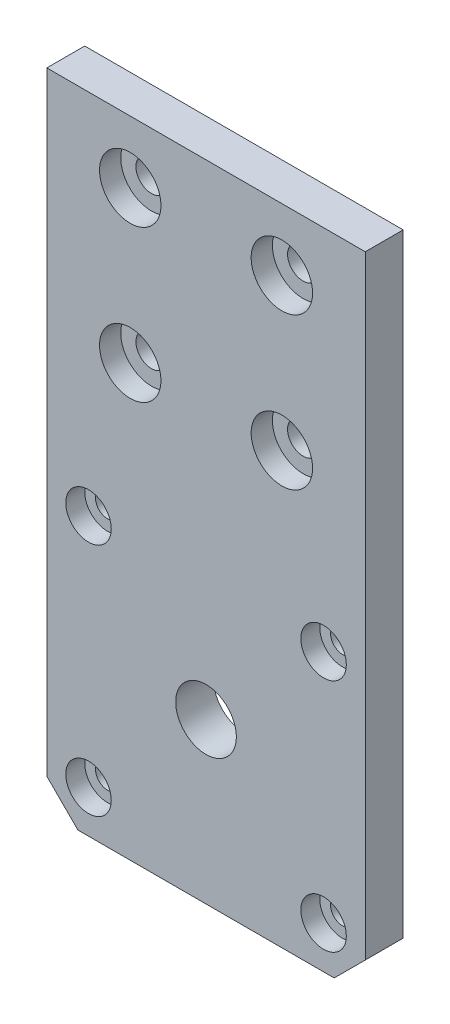
ISO-10303-21;
HEADER;
FILE_DESCRIPTION(('STEP AP214'),'2;1');
FILE_NAME('part.step','',(''),(''),'','','');
FILE_SCHEMA(('AUTOMOTIVE_DESIGN { 1 0 10303 214 1 1 1 1 }'));
ENDSEC;
DATA;
#1=APPLICATION_CONTEXT('core data for automotive mechanical design processes');
#2=APPLICATION_PROTOCOL_DEFINITION('international standard','automotive_design',2000,#1);
#3=PRODUCT_CONTEXT('',#1,'mechanical');
#4=PRODUCT('Part','Part','',(#3));
#5=PRODUCT_RELATED_PRODUCT_CATEGORY('part','',(#4));
#6=PRODUCT_DEFINITION_FORMATION('','',#4);
#7=PRODUCT_DEFINITION_CONTEXT('part definition',#1,'design');
#8=PRODUCT_DEFINITION('design','',#6,#7);
#9=PRODUCT_DEFINITION_SHAPE('','',#8);
#10=(LENGTH_UNIT() NAMED_UNIT(*) SI_UNIT(.MILLI.,.METRE.));
#11=(NAMED_UNIT(*) PLANE_ANGLE_UNIT() SI_UNIT($,.RADIAN.));
#12=(NAMED_UNIT(*) SI_UNIT($,.STERADIAN.) SOLID_ANGLE_UNIT());
#13=UNCERTAINTY_MEASURE_WITH_UNIT(LENGTH_MEASURE(1.E-05),#10,'distance_accuracy_value','');
#14=(GEOMETRIC_REPRESENTATION_CONTEXT(3) GLOBAL_UNCERTAINTY_ASSIGNED_CONTEXT((#13)) GLOBAL_UNIT_ASSIGNED_CONTEXT((#10,
#11,#12)) REPRESENTATION_CONTEXT('',''));
#15=CARTESIAN_POINT('',(0.,0.,0.));
#16=DIRECTION('',(0.,0.,1.));
#17=DIRECTION('',(1.,0.,0.));
#18=AXIS2_PLACEMENT_3D('',#15,#16,#17);
#19=CARTESIAN_POINT('',(5.50000000000001,5.58,0.));
#20=DIRECTION('',(0.,0.,1.));
#21=DIRECTION('',(1.,0.,0.));
#22=AXIS2_PLACEMENT_3D('',#19,#20,#21);
#23=CYLINDRICAL_SURFACE('',#22,1.575);
#24=CARTESIAN_POINT('',(5.50000000000001,5.58,0.));
#25=DIRECTION('',(0.,0.,1.));
#26=DIRECTION('',(1.,0.,0.));
#27=AXIS2_PLACEMENT_3D('',#24,#25,#26);
#28=CIRCLE('',#27,1.575);
#29=CARTESIAN_POINT('',(7.07500000000001,5.58,0.));
#30=VERTEX_POINT('',#29);
#31=EDGE_CURVE('E223',#30,#30,#28,.T.);
#32=ORIENTED_EDGE('',*,*,#31,.F.);
#33=EDGE_LOOP('',(#32));
#34=FACE_BOUND('',#33,.T.);
#35=CARTESIAN_POINT('',(5.50000000000001,5.58,2.5));
#36=DIRECTION('',(0.,0.,1.));
#37=DIRECTION('',(1.,0.,0.));
#38=AXIS2_PLACEMENT_3D('',#35,#36,#37);
#39=CIRCLE('',#38,1.575);
#40=CARTESIAN_POINT('',(7.07500000000001,5.58,2.5));
#41=VERTEX_POINT('',#40);
#42=EDGE_CURVE('E160',#41,#41,#39,.F.);
#43=ORIENTED_EDGE('',*,*,#42,.F.);
#44=EDGE_LOOP('',(#43));
#45=FACE_BOUND('',#44,.T.);
#46=ADVANCED_FACE('F34',(#34,#45),#23,.F.);
#47=CARTESIAN_POINT('',(36.5,5.58000000000001,0.));
#48=DIRECTION('',(0.,0.,1.));
#49=DIRECTION('',(1.,0.,0.));
#50=AXIS2_PLACEMENT_3D('',#47,#48,#49);
#51=CYLINDRICAL_SURFACE('',#50,1.575);
#52=CARTESIAN_POINT('',(36.5,5.58000000000001,0.));
#53=DIRECTION('',(0.,0.,1.));
#54=DIRECTION('',(1.,0.,0.));
#55=AXIS2_PLACEMENT_3D('',#52,#53,#54);
#56=CIRCLE('',#55,1.575);
#57=CARTESIAN_POINT('',(38.075,5.58000000000001,0.));
#58=VERTEX_POINT('',#57);
#59=EDGE_CURVE('E220',#58,#58,#56,.T.);
#60=ORIENTED_EDGE('',*,*,#59,.F.);
#61=EDGE_LOOP('',(#60));
#62=FACE_BOUND('',#61,.T.);
#63=CARTESIAN_POINT('',(36.5,5.58000000000001,2.5));
#64=DIRECTION('',(0.,0.,1.));
#65=DIRECTION('',(1.,0.,0.));
#66=AXIS2_PLACEMENT_3D('',#63,#64,#65);
#67=CIRCLE('',#66,1.575);
#68=CARTESIAN_POINT('',(38.075,5.58000000000001,2.5));
#69=VERTEX_POINT('',#68);
#70=EDGE_CURVE('E155',#69,#69,#67,.F.);
#71=ORIENTED_EDGE('',*,*,#70,.F.);
#72=EDGE_LOOP('',(#71));
#73=FACE_BOUND('',#72,.T.);
#74=ADVANCED_FACE('F295',(#62,#73),#51,.F.);
#75=CARTESIAN_POINT('',(36.5,36.58,0.));
#76=DIRECTION('',(0.,0.,1.));
#77=DIRECTION('',(1.,0.,0.));
#78=AXIS2_PLACEMENT_3D('',#75,#76,#77);
#79=CYLINDRICAL_SURFACE('',#78,1.575);
#80=CARTESIAN_POINT('',(36.5,36.58,0.));
#81=DIRECTION('',(0.,0.,1.));
#82=DIRECTION('',(1.,0.,0.));
#83=AXIS2_PLACEMENT_3D('',#80,#81,#82);
#84=CIRCLE('',#83,1.575);
#85=CARTESIAN_POINT('',(38.075,36.58,0.));
#86=VERTEX_POINT('',#85);
#87=EDGE_CURVE('E217',#86,#86,#84,.T.);
#88=ORIENTED_EDGE('',*,*,#87,.F.);
#89=EDGE_LOOP('',(#88));
#90=FACE_BOUND('',#89,.T.);
#91=CARTESIAN_POINT('',(36.5,36.58,2.5));
#92=DIRECTION('',(0.,0.,1.));
#93=DIRECTION('',(1.,0.,0.));
#94=AXIS2_PLACEMENT_3D('',#91,#92,#93);
#95=CIRCLE('',#94,1.575);
#96=CARTESIAN_POINT('',(38.075,36.58,2.5));
#97=VERTEX_POINT('',#96);
#98=EDGE_CURVE('E150',#97,#97,#95,.F.);
#99=ORIENTED_EDGE('',*,*,#98,.F.);
#100=EDGE_LOOP('',(#99));
#101=FACE_BOUND('',#100,.T.);
#102=ADVANCED_FACE('F301',(#90,#101),#79,.F.);
#103=CARTESIAN_POINT('',(5.5,36.58,0.));
#104=DIRECTION('',(0.,0.,1.));
#105=DIRECTION('',(1.,0.,0.));
#106=AXIS2_PLACEMENT_3D('',#103,#104,#105);
#107=CYLINDRICAL_SURFACE('',#106,1.575);
#108=CARTESIAN_POINT('',(5.5,36.58,0.));
#109=DIRECTION('',(0.,0.,1.));
#110=DIRECTION('',(1.,0.,0.));
#111=AXIS2_PLACEMENT_3D('',#108,#109,#110);
#112=CIRCLE('',#111,1.575);
#113=CARTESIAN_POINT('',(7.075,36.58,0.));
#114=VERTEX_POINT('',#113);
#115=EDGE_CURVE('E212',#114,#114,#112,.T.);
#116=ORIENTED_EDGE('',*,*,#115,.F.);
#117=EDGE_LOOP('',(#116));
#118=FACE_BOUND('',#117,.T.);
#119=CARTESIAN_POINT('',(5.5,36.58,2.5));
#120=DIRECTION('',(0.,0.,1.));
#121=DIRECTION('',(1.,0.,0.));
#122=AXIS2_PLACEMENT_3D('',#119,#120,#121);
#123=CIRCLE('',#122,1.575);
#124=CARTESIAN_POINT('',(7.075,36.58,2.5));
#125=VERTEX_POINT('',#124);
#126=EDGE_CURVE('E145',#125,#125,#123,.F.);
#127=ORIENTED_EDGE('',*,*,#126,.F.);
#128=EDGE_LOOP('',(#127));
#129=FACE_BOUND('',#128,.T.);
#130=ADVANCED_FACE('F312',(#118,#129),#107,.F.);
#131=CARTESIAN_POINT('',(31.,76.8,5.));
#132=DIRECTION('',(0.,0.,-1.));
#133=DIRECTION('',(-1.,0.,0.));
#134=AXIS2_PLACEMENT_3D('',#131,#132,#133);
#135=CYLINDRICAL_SURFACE('',#134,2.04999999999999);
#136=CARTESIAN_POINT('',(31.,76.8,0.));
#137=DIRECTION('',(0.,0.,1.));
#138=DIRECTION('',(1.,0.,0.));
#139=AXIS2_PLACEMENT_3D('',#136,#137,#138);
#140=CIRCLE('',#139,2.04999999999999);
#141=CARTESIAN_POINT('',(33.05,76.8,0.));
#142=VERTEX_POINT('',#141);
#143=EDGE_CURVE('E189',#142,#142,#140,.T.);
#144=ORIENTED_EDGE('',*,*,#143,.F.);
#145=EDGE_LOOP('',(#144));
#146=FACE_BOUND('',#145,.T.);
#147=CARTESIAN_POINT('',(31.,76.8,2.2));
#148=DIRECTION('',(0.,0.,1.));
#149=DIRECTION('',(1.,0.,0.));
#150=AXIS2_PLACEMENT_3D('',#147,#148,#149);
#151=CIRCLE('',#150,2.04999999999999);
#152=CARTESIAN_POINT('',(33.05,76.8,2.2));
#153=VERTEX_POINT('',#152);
#154=EDGE_CURVE('E140',#153,#153,#151,.T.);
#155=ORIENTED_EDGE('',*,*,#154,.T.);
#156=EDGE_LOOP('',(#155));
#157=FACE_BOUND('',#156,.T.);
#158=ADVANCED_FACE('F316',(#146,#157),#135,.F.);
#159=CARTESIAN_POINT('',(31.,56.8,5.));
#160=DIRECTION('',(0.,0.,-1.));
#161=DIRECTION('',(-1.,0.,0.));
#162=AXIS2_PLACEMENT_3D('',#159,#160,#161);
#163=CYLINDRICAL_SURFACE('',#162,2.04999999999999);
#164=CARTESIAN_POINT('',(31.,56.8,0.));
#165=DIRECTION('',(0.,0.,1.));
#166=DIRECTION('',(1.,0.,0.));
#167=AXIS2_PLACEMENT_3D('',#164,#165,#166);
#168=CIRCLE('',#167,2.04999999999999);
#169=CARTESIAN_POINT('',(33.05,56.8,0.));
#170=VERTEX_POINT('',#169);
#171=EDGE_CURVE('E192',#170,#170,#168,.T.);
#172=ORIENTED_EDGE('',*,*,#171,.F.);
#173=EDGE_LOOP('',(#172));
#174=FACE_BOUND('',#173,.T.);
#175=CARTESIAN_POINT('',(31.,56.8,2.2));
#176=DIRECTION('',(0.,0.,1.));
#177=DIRECTION('',(1.,0.,0.));
#178=AXIS2_PLACEMENT_3D('',#175,#176,#177);
#179=CIRCLE('',#178,2.04999999999999);
#180=CARTESIAN_POINT('',(33.05,56.8,2.2));
#181=VERTEX_POINT('',#180);
#182=EDGE_CURVE('E135',#181,#181,#179,.T.);
#183=ORIENTED_EDGE('',*,*,#182,.T.);
#184=EDGE_LOOP('',(#183));
#185=FACE_BOUND('',#184,.T.);
#186=ADVANCED_FACE('F513',(#174,#185),#163,.F.);
#187=CARTESIAN_POINT('',(11.,56.8,5.));
#188=DIRECTION('',(0.,0.,-1.));
#189=DIRECTION('',(-1.,0.,0.));
#190=AXIS2_PLACEMENT_3D('',#187,#188,#189);
#191=CYLINDRICAL_SURFACE('',#190,2.05000000000001);
#192=CARTESIAN_POINT('',(11.,56.8,0.));
#193=DIRECTION('',(0.,0.,1.));
#194=DIRECTION('',(1.,0.,0.));
#195=AXIS2_PLACEMENT_3D('',#192,#193,#194);
#196=CIRCLE('',#195,2.05000000000001);
#197=CARTESIAN_POINT('',(13.05,56.8,0.));
#198=VERTEX_POINT('',#197);
#199=EDGE_CURVE('E128',#198,#198,#196,.T.);
#200=ORIENTED_EDGE('',*,*,#199,.F.);
#201=EDGE_LOOP('',(#200));
#202=FACE_BOUND('',#201,.T.);
#203=CARTESIAN_POINT('',(11.,56.8,2.2));
#204=DIRECTION('',(0.,0.,1.));
#205=DIRECTION('',(1.,0.,0.));
#206=AXIS2_PLACEMENT_3D('',#203,#204,#205);
#207=CIRCLE('',#206,2.05000000000001);
#208=CARTESIAN_POINT('',(13.05,56.8,2.2));
#209=VERTEX_POINT('',#208);
#210=EDGE_CURVE('E130',#209,#209,#207,.T.);
#211=ORIENTED_EDGE('',*,*,#210,.T.);
#212=EDGE_LOOP('',(#211));
#213=FACE_BOUND('',#212,.T.);
#214=ADVANCED_FACE('F523',(#202,#213),#191,.F.);
#215=CARTESIAN_POINT('',(11.,76.8,5.));
#216=DIRECTION('',(0.,0.,-1.));
#217=DIRECTION('',(-1.,0.,0.));
#218=AXIS2_PLACEMENT_3D('',#215,#216,#217);
#219=CYLINDRICAL_SURFACE('',#218,2.04999999999999);
#220=CARTESIAN_POINT('',(11.,76.8,0.));
#221=DIRECTION('',(0.,0.,1.));
#222=DIRECTION('',(1.,0.,0.));
#223=AXIS2_PLACEMENT_3D('',#220,#221,#222);
#224=CIRCLE('',#223,2.04999999999999);
#225=CARTESIAN_POINT('',(13.05,76.8,0.));
#226=VERTEX_POINT('',#225);
#227=EDGE_CURVE('E119',#226,#226,#224,.T.);
#228=ORIENTED_EDGE('',*,*,#227,.F.);
#229=EDGE_LOOP('',(#228));
#230=FACE_BOUND('',#229,.T.);
#231=CARTESIAN_POINT('',(11.,76.8,2.2));
#232=DIRECTION('',(0.,0.,1.));
#233=DIRECTION('',(1.,0.,0.));
#234=AXIS2_PLACEMENT_3D('',#231,#232,#233);
#235=CIRCLE('',#234,2.04999999999999);
#236=CARTESIAN_POINT('',(13.05,76.8,2.2));
#237=VERTEX_POINT('',#236);
#238=EDGE_CURVE('E125',#237,#237,#235,.T.);
#239=ORIENTED_EDGE('',*,*,#238,.T.);
#240=EDGE_LOOP('',(#239));
#241=FACE_BOUND('',#240,.T.);
#242=ADVANCED_FACE('F261',(#230,#241),#219,.F.);
#243=CARTESIAN_POINT('',(0.,0.,5.));
#244=DIRECTION('',(0.,0.,1.));
#245=DIRECTION('',(1.,0.,0.));
#246=AXIS2_PLACEMENT_3D('',#243,#244,#245);
#247=PLANE('',#246);
#248=CARTESIAN_POINT('',(5.50000000000001,5.58,5.));
#249=DIRECTION('',(0.,0.,1.));
#250=DIRECTION('',(1.,0.,0.));
#251=AXIS2_PLACEMENT_3D('',#248,#249,#250);
#252=CIRCLE('',#251,3.);
#253=CARTESIAN_POINT('',(8.50000000000001,5.58,5.));
#254=VERTEX_POINT('',#253);
#255=EDGE_CURVE('E243',#254,#254,#252,.T.);
#256=ORIENTED_EDGE('',*,*,#255,.F.);
#257=EDGE_LOOP('',(#256));
#258=FACE_BOUND('',#257,.T.);
#259=CARTESIAN_POINT('',(36.5,5.58000000000001,5.));
#260=DIRECTION('',(0.,0.,1.));
#261=DIRECTION('',(1.,0.,0.));
#262=AXIS2_PLACEMENT_3D('',#259,#260,#261);
#263=CIRCLE('',#262,3.);
#264=CARTESIAN_POINT('',(39.5,5.58000000000001,5.));
#265=VERTEX_POINT('',#264);
#266=EDGE_CURVE('E163',#265,#265,#263,.T.);
#267=ORIENTED_EDGE('',*,*,#266,.F.);
#268=EDGE_LOOP('',(#267));
#269=FACE_BOUND('',#268,.T.);
#270=CARTESIAN_POINT('',(36.5,36.58,5.));
#271=DIRECTION('',(0.,0.,1.));
#272=DIRECTION('',(1.,0.,0.));
#273=AXIS2_PLACEMENT_3D('',#270,#271,#272);
#274=CIRCLE('',#273,3.);
#275=CARTESIAN_POINT('',(39.5,36.58,5.));
#276=VERTEX_POINT('',#275);
#277=EDGE_CURVE('E158',#276,#276,#274,.T.);
#278=ORIENTED_EDGE('',*,*,#277,.F.);
#279=EDGE_LOOP('',(#278));
#280=FACE_BOUND('',#279,.T.);
#281=CARTESIAN_POINT('',(5.5,36.58,5.));
#282=DIRECTION('',(0.,0.,1.));
#283=DIRECTION('',(1.,0.,0.));
#284=AXIS2_PLACEMENT_3D('',#281,#282,#283);
#285=CIRCLE('',#284,3.);
#286=CARTESIAN_POINT('',(8.5,36.58,5.));
#287=VERTEX_POINT('',#286);
#288=EDGE_CURVE('E153',#287,#287,#285,.T.);
#289=ORIENTED_EDGE('',*,*,#288,.F.);
#290=EDGE_LOOP('',(#289));
#291=FACE_BOUND('',#290,.T.);
#292=CARTESIAN_POINT('',(21.,21.08,5.));
#293=DIRECTION('',(0.,0.,1.));
#294=DIRECTION('',(1.,0.,0.));
#295=AXIS2_PLACEMENT_3D('',#292,#293,#294);
#296=CIRCLE('',#295,4.);
#297=CARTESIAN_POINT('',(25.,21.08,5.));
#298=VERTEX_POINT('',#297);
#299=EDGE_CURVE('E148',#298,#298,#296,.T.);
#300=ORIENTED_EDGE('',*,*,#299,.F.);
#301=EDGE_LOOP('',(#300));
#302=FACE_BOUND('',#301,.T.);
#303=CARTESIAN_POINT('',(31.,76.8,5.));
#304=DIRECTION('',(0.,0.,1.));
#305=DIRECTION('',(1.,0.,0.));
#306=AXIS2_PLACEMENT_3D('',#303,#304,#305);
#307=CIRCLE('',#306,4.04999999999999);
#308=CARTESIAN_POINT('',(35.05,76.8,5.));
#309=VERTEX_POINT('',#308);
#310=EDGE_CURVE('E209',#309,#309,#307,.T.);
#311=ORIENTED_EDGE('',*,*,#310,.F.);
#312=EDGE_LOOP('',(#311));
#313=FACE_BOUND('',#312,.T.);
#314=CARTESIAN_POINT('',(31.,56.8,5.));
#315=DIRECTION('',(0.,0.,1.));
#316=DIRECTION('',(1.,0.,0.));
#317=AXIS2_PLACEMENT_3D('',#314,#315,#316);
#318=CIRCLE('',#317,4.04999999999999);
#319=CARTESIAN_POINT('',(35.05,56.8,5.));
#320=VERTEX_POINT('',#319);
#321=EDGE_CURVE('E143',#320,#320,#318,.T.);
#322=ORIENTED_EDGE('',*,*,#321,.F.);
#323=EDGE_LOOP('',(#322));
#324=FACE_BOUND('',#323,.T.);
#325=CARTESIAN_POINT('',(11.,56.8,5.));
#326=DIRECTION('',(0.,0.,1.));
#327=DIRECTION('',(1.,0.,0.));
#328=AXIS2_PLACEMENT_3D('',#325,#326,#327);
#329=CIRCLE('',#328,4.05);
#330=CARTESIAN_POINT('',(15.05,56.8,5.));
#331=VERTEX_POINT('',#330);
#332=EDGE_CURVE('E138',#331,#331,#329,.T.);
#333=ORIENTED_EDGE('',*,*,#332,.F.);
#334=EDGE_LOOP('',(#333));
#335=FACE_BOUND('',#334,.T.);
#336=CARTESIAN_POINT('',(11.,76.8,5.));
#337=DIRECTION('',(0.,0.,1.));
#338=DIRECTION('',(1.,0.,0.));
#339=AXIS2_PLACEMENT_3D('',#336,#337,#338);
#340=CIRCLE('',#339,4.05);
#341=CARTESIAN_POINT('',(15.05,76.8,5.));
#342=VERTEX_POINT('',#341);
#343=EDGE_CURVE('E133',#342,#342,#340,.T.);
#344=ORIENTED_EDGE('',*,*,#343,.F.);
#345=EDGE_LOOP('',(#344));
#346=FACE_BOUND('',#345,.T.);
#347=DIRECTION('',(1.,0.,0.));
#348=VECTOR('',#347,1.);
#349=CARTESIAN_POINT('',(0.,0.,5.));
#350=LINE('',#349,#348);
#351=CARTESIAN_POINT('',(4.10000000000001,0.,5.));
#352=VERTEX_POINT('',#351);
#353=CARTESIAN_POINT('',(37.9,0.,5.));
#354=VERTEX_POINT('',#353);
#355=EDGE_CURVE('E98',#352,#354,#350,.T.);
#356=ORIENTED_EDGE('',*,*,#355,.T.);
#357=DIRECTION('',(-0.707106781186549,-0.707106781186546,0.));
#358=VECTOR('',#357,1.);
#359=CARTESIAN_POINT('',(18.9499999999999,-18.95,5.));
#360=LINE('',#359,#358);
#361=CARTESIAN_POINT('',(42.,4.1,5.));
#362=VERTEX_POINT('',#361);
#363=EDGE_CURVE('E42',#354,#362,#360,.F.);
#364=ORIENTED_EDGE('',*,*,#363,.T.);
#365=DIRECTION('',(0.,1.,0.));
#366=VECTOR('',#365,1.);
#367=CARTESIAN_POINT('',(42.,85.,5.));
#368=LINE('',#367,#366);
#369=CARTESIAN_POINT('',(42.,85.,5.));
#370=VERTEX_POINT('',#369);
#371=EDGE_CURVE('E88',#362,#370,#368,.T.);
#372=ORIENTED_EDGE('',*,*,#371,.T.);
#373=DIRECTION('',(-1.,0.,0.));
#374=VECTOR('',#373,1.);
#375=CARTESIAN_POINT('',(0.,85.,5.));
#376=LINE('',#375,#374);
#377=CARTESIAN_POINT('',(0.,85.,5.));
#378=VERTEX_POINT('',#377);
#379=EDGE_CURVE('E92',#370,#378,#376,.T.);
#380=ORIENTED_EDGE('',*,*,#379,.T.);
#381=DIRECTION('',(0.,-1.,0.));
#382=VECTOR('',#381,1.);
#383=CARTESIAN_POINT('',(0.,85.,5.));
#384=LINE('',#383,#382);
#385=CARTESIAN_POINT('',(0.,4.10000000000003,5.));
#386=VERTEX_POINT('',#385);
#387=EDGE_CURVE('E123',#378,#386,#384,.T.);
#388=ORIENTED_EDGE('',*,*,#387,.T.);
#389=DIRECTION('',(-0.707106781186546,0.707106781186549,0.));
#390=VECTOR('',#389,1.);
#391=CARTESIAN_POINT('',(2.05000000000001,2.05,5.));
#392=LINE('',#391,#390);
#393=EDGE_CURVE('E174',#386,#352,#392,.F.);
#394=ORIENTED_EDGE('',*,*,#393,.T.);
#395=EDGE_LOOP('',(#356,#364,#372,#380,#388,#394));
#396=FACE_BOUND('',#395,.T.);
#397=ADVANCED_FACE('F90',(#258,#269,#280,#291,#302,#313,#324,#335,#346,#396),#247,.T.);
#398=CARTESIAN_POINT('',(0.,0.,0.));
#399=DIRECTION('',(0.,0.,1.));
#400=DIRECTION('',(1.,0.,0.));
#401=AXIS2_PLACEMENT_3D('',#398,#399,#400);
#402=PLANE('',#401);
#403=CARTESIAN_POINT('',(21.,21.08,0.));
#404=DIRECTION('',(0.,0.,1.));
#405=DIRECTION('',(1.,0.,0.));
#406=AXIS2_PLACEMENT_3D('',#403,#404,#405);
#407=CIRCLE('',#406,4.);
#408=CARTESIAN_POINT('',(25.,21.08,0.));
#409=VERTEX_POINT('',#408);
#410=EDGE_CURVE('E226',#409,#409,#407,.T.);
#411=ORIENTED_EDGE('',*,*,#410,.T.);
#412=EDGE_LOOP('',(#411));
#413=FACE_BOUND('',#412,.T.);
#414=ORIENTED_EDGE('',*,*,#31,.T.);
#415=EDGE_LOOP('',(#414));
#416=FACE_BOUND('',#415,.T.);
#417=ORIENTED_EDGE('',*,*,#59,.T.);
#418=EDGE_LOOP('',(#417));
#419=FACE_BOUND('',#418,.T.);
#420=ORIENTED_EDGE('',*,*,#87,.T.);
#421=EDGE_LOOP('',(#420));
#422=FACE_BOUND('',#421,.T.);
#423=ORIENTED_EDGE('',*,*,#115,.T.);
#424=EDGE_LOOP('',(#423));
#425=FACE_BOUND('',#424,.T.);
#426=DIRECTION('',(0.,1.,0.));
#427=VECTOR('',#426,1.);
#428=CARTESIAN_POINT('',(42.,85.,0.));
#429=LINE('',#428,#427);
#430=CARTESIAN_POINT('',(42.,4.1,0.));
#431=VERTEX_POINT('',#430);
#432=CARTESIAN_POINT('',(42.,85.,0.));
#433=VERTEX_POINT('',#432);
#434=EDGE_CURVE('E104',#431,#433,#429,.T.);
#435=ORIENTED_EDGE('',*,*,#434,.F.);
#436=DIRECTION('',(0.707106781186549,0.707106781186546,0.));
#437=VECTOR('',#436,1.);
#438=CARTESIAN_POINT('',(42.,4.10000000000001,0.));
#439=LINE('',#438,#437);
#440=CARTESIAN_POINT('',(37.9,0.,0.));
#441=VERTEX_POINT('',#440);
#442=EDGE_CURVE('E168',#431,#441,#439,.F.);
#443=ORIENTED_EDGE('',*,*,#442,.T.);
#444=DIRECTION('',(1.,0.,0.));
#445=VECTOR('',#444,1.);
#446=CARTESIAN_POINT('',(0.,0.,0.));
#447=LINE('',#446,#445);
#448=CARTESIAN_POINT('',(4.10000000000001,0.,0.));
#449=VERTEX_POINT('',#448);
#450=EDGE_CURVE('E118',#449,#441,#447,.T.);
#451=ORIENTED_EDGE('',*,*,#450,.F.);
#452=DIRECTION('',(0.707106781186546,-0.707106781186549,0.));
#453=VECTOR('',#452,1.);
#454=CARTESIAN_POINT('',(4.10000000000001,0.,0.));
#455=LINE('',#454,#453);
#456=CARTESIAN_POINT('',(0.,4.10000000000002,0.));
#457=VERTEX_POINT('',#456);
#458=EDGE_CURVE('E166',#449,#457,#455,.F.);
#459=ORIENTED_EDGE('',*,*,#458,.T.);
#460=DIRECTION('',(0.,-1.,0.));
#461=VECTOR('',#460,1.);
#462=CARTESIAN_POINT('',(0.,85.,0.));
#463=LINE('',#462,#461);
#464=CARTESIAN_POINT('',(0.,85.,0.));
#465=VERTEX_POINT('',#464);
#466=EDGE_CURVE('E116',#465,#457,#463,.T.);
#467=ORIENTED_EDGE('',*,*,#466,.F.);
#468=DIRECTION('',(-1.,0.,0.));
#469=VECTOR('',#468,1.);
#470=CARTESIAN_POINT('',(0.,85.,0.));
#471=LINE('',#470,#469);
#472=EDGE_CURVE('E122',#433,#465,#471,.T.);
#473=ORIENTED_EDGE('',*,*,#472,.F.);
#474=EDGE_LOOP('',(#435,#443,#451,#459,#467,#473));
#475=FACE_BOUND('',#474,.T.);
#476=ORIENTED_EDGE('',*,*,#227,.T.);
#477=EDGE_LOOP('',(#476));
#478=FACE_BOUND('',#477,.T.);
#479=ORIENTED_EDGE('',*,*,#143,.T.);
#480=EDGE_LOOP('',(#479));
#481=FACE_BOUND('',#480,.T.);
#482=ORIENTED_EDGE('',*,*,#171,.T.);
#483=EDGE_LOOP('',(#482));
#484=FACE_BOUND('',#483,.T.);
#485=ORIENTED_EDGE('',*,*,#199,.T.);
#486=EDGE_LOOP('',(#485));
#487=FACE_BOUND('',#486,.T.);
#488=ADVANCED_FACE('F182',(#413,#416,#419,#422,#425,#475,#478,#481,#484,#487),#402,.F.);
#489=CARTESIAN_POINT('',(0.,85.,5.));
#490=DIRECTION('',(1.,0.,0.));
#491=DIRECTION('',(0.,1.,0.));
#492=AXIS2_PLACEMENT_3D('',#489,#490,#491);
#493=PLANE('',#492);
#494=ORIENTED_EDGE('',*,*,#466,.T.);
#495=DIRECTION('',(0.,0.,1.));
#496=VECTOR('',#495,1.);
#497=CARTESIAN_POINT('',(0.,4.10000000000002,5.));
#498=LINE('',#497,#496);
#499=EDGE_CURVE('E11',#457,#386,#498,.T.);
#500=ORIENTED_EDGE('',*,*,#499,.T.);
#501=ORIENTED_EDGE('',*,*,#387,.F.);
#502=DIRECTION('',(0.,0.,-1.));
#503=VECTOR('',#502,1.);
#504=CARTESIAN_POINT('',(0.,85.,5.));
#505=LINE('',#504,#503);
#506=EDGE_CURVE('E108',#378,#465,#505,.T.);
#507=ORIENTED_EDGE('',*,*,#506,.T.);
#508=EDGE_LOOP('',(#494,#500,#501,#507));
#509=FACE_BOUND('',#508,.T.);
#510=ADVANCED_FACE('F184',(#509),#493,.F.);
#511=CARTESIAN_POINT('',(0.,0.,5.));
#512=DIRECTION('',(0.,1.,0.));
#513=DIRECTION('',(0.,0.,1.));
#514=AXIS2_PLACEMENT_3D('',#511,#512,#513);
#515=PLANE('',#514);
#516=ORIENTED_EDGE('',*,*,#450,.T.);
#517=DIRECTION('',(0.,0.,1.));
#518=VECTOR('',#517,1.);
#519=CARTESIAN_POINT('',(37.9,0.,5.));
#520=LINE('',#519,#518);
#521=EDGE_CURVE('E55',#441,#354,#520,.T.);
#522=ORIENTED_EDGE('',*,*,#521,.T.);
#523=ORIENTED_EDGE('',*,*,#355,.F.);
#524=DIRECTION('',(0.,0.,-1.));
#525=VECTOR('',#524,1.);
#526=CARTESIAN_POINT('',(4.10000000000001,0.,5.));
#527=LINE('',#526,#525);
#528=EDGE_CURVE('E170',#352,#449,#527,.T.);
#529=ORIENTED_EDGE('',*,*,#528,.T.);
#530=EDGE_LOOP('',(#516,#522,#523,#529));
#531=FACE_BOUND('',#530,.T.);
#532=ADVANCED_FACE('F178',(#531),#515,.F.);
#533=CARTESIAN_POINT('',(42.,85.,5.));
#534=DIRECTION('',(-1.,0.,0.));
#535=DIRECTION('',(0.,0.,1.));
#536=AXIS2_PLACEMENT_3D('',#533,#534,#535);
#537=PLANE('',#536);
#538=ORIENTED_EDGE('',*,*,#371,.F.);
#539=DIRECTION('',(0.,0.,-1.));
#540=VECTOR('',#539,1.);
#541=CARTESIAN_POINT('',(42.,4.10000000000001,5.));
#542=LINE('',#541,#540);
#543=EDGE_CURVE('E107',#362,#431,#542,.T.);
#544=ORIENTED_EDGE('',*,*,#543,.T.);
#545=ORIENTED_EDGE('',*,*,#434,.T.);
#546=DIRECTION('',(0.,0.,-1.));
#547=VECTOR('',#546,1.);
#548=CARTESIAN_POINT('',(42.,85.,5.));
#549=LINE('',#548,#547);
#550=EDGE_CURVE('E101',#370,#433,#549,.T.);
#551=ORIENTED_EDGE('',*,*,#550,.F.);
#552=EDGE_LOOP('',(#538,#544,#545,#551));
#553=FACE_BOUND('',#552,.T.);
#554=ADVANCED_FACE('F102',(#553),#537,.F.);
#555=CARTESIAN_POINT('',(0.,85.,5.));
#556=DIRECTION('',(0.,-1.,0.));
#557=DIRECTION('',(0.,0.,-1.));
#558=AXIS2_PLACEMENT_3D('',#555,#556,#557);
#559=PLANE('',#558);
#560=ORIENTED_EDGE('',*,*,#472,.T.);
#561=ORIENTED_EDGE('',*,*,#506,.F.);
#562=ORIENTED_EDGE('',*,*,#379,.F.);
#563=ORIENTED_EDGE('',*,*,#550,.T.);
#564=EDGE_LOOP('',(#560,#561,#562,#563));
#565=FACE_BOUND('',#564,.T.);
#566=ADVANCED_FACE('F110',(#565),#559,.F.);
#567=CARTESIAN_POINT('',(11.,76.8,2.2));
#568=DIRECTION('',(0.,0.,1.));
#569=DIRECTION('',(1.,0.,0.));
#570=AXIS2_PLACEMENT_3D('',#567,#568,#569);
#571=CYLINDRICAL_SURFACE('',#570,4.05);
#572=CARTESIAN_POINT('',(11.,76.8,2.2));
#573=DIRECTION('',(0.,0.,1.));
#574=DIRECTION('',(1.,0.,0.));
#575=AXIS2_PLACEMENT_3D('',#572,#573,#574);
#576=CIRCLE('',#575,4.05);
#577=CARTESIAN_POINT('',(15.05,76.8,2.2));
#578=VERTEX_POINT('',#577);
#579=EDGE_CURVE('E129',#578,#578,#576,.T.);
#580=ORIENTED_EDGE('',*,*,#579,.F.);
#581=EDGE_LOOP('',(#580));
#582=FACE_BOUND('',#581,.T.);
#583=ORIENTED_EDGE('',*,*,#343,.T.);
#584=EDGE_LOOP('',(#583));
#585=FACE_BOUND('',#584,.T.);
#586=ADVANCED_FACE('F279',(#582,#585),#571,.F.);
#587=CARTESIAN_POINT('',(11.,76.8,2.2));
#588=DIRECTION('',(0.,0.,1.));
#589=DIRECTION('',(1.,0.,0.));
#590=AXIS2_PLACEMENT_3D('',#587,#588,#589);
#591=PLANE('',#590);
#592=ORIENTED_EDGE('',*,*,#238,.F.);
#593=EDGE_LOOP('',(#592));
#594=FACE_BOUND('',#593,.T.);
#595=ORIENTED_EDGE('',*,*,#579,.T.);
#596=EDGE_LOOP('',(#595));
#597=FACE_BOUND('',#596,.T.);
#598=ADVANCED_FACE('F281',(#594,#597),#591,.T.);
#599=CARTESIAN_POINT('',(11.,56.8,2.2));
#600=DIRECTION('',(0.,0.,1.));
#601=DIRECTION('',(1.,0.,0.));
#602=AXIS2_PLACEMENT_3D('',#599,#600,#601);
#603=CYLINDRICAL_SURFACE('',#602,4.05);
#604=CARTESIAN_POINT('',(11.,56.8,2.2));
#605=DIRECTION('',(0.,0.,1.));
#606=DIRECTION('',(1.,0.,0.));
#607=AXIS2_PLACEMENT_3D('',#604,#605,#606);
#608=CIRCLE('',#607,4.05);
#609=CARTESIAN_POINT('',(15.05,56.8,2.2));
#610=VERTEX_POINT('',#609);
#611=EDGE_CURVE('E134',#610,#610,#608,.T.);
#612=ORIENTED_EDGE('',*,*,#611,.F.);
#613=EDGE_LOOP('',(#612));
#614=FACE_BOUND('',#613,.T.);
#615=ORIENTED_EDGE('',*,*,#332,.T.);
#616=EDGE_LOOP('',(#615));
#617=FACE_BOUND('',#616,.T.);
#618=ADVANCED_FACE('F288',(#614,#617),#603,.F.);
#619=CARTESIAN_POINT('',(11.,56.8,2.2));
#620=DIRECTION('',(0.,0.,1.));
#621=DIRECTION('',(1.,0.,0.));
#622=AXIS2_PLACEMENT_3D('',#619,#620,#621);
#623=PLANE('',#622);
#624=ORIENTED_EDGE('',*,*,#210,.F.);
#625=EDGE_LOOP('',(#624));
#626=FACE_BOUND('',#625,.T.);
#627=ORIENTED_EDGE('',*,*,#611,.T.);
#628=EDGE_LOOP('',(#627));
#629=FACE_BOUND('',#628,.T.);
#630=ADVANCED_FACE('F333',(#626,#629),#623,.T.);
#631=CARTESIAN_POINT('',(31.,56.8,2.2));
#632=DIRECTION('',(0.,0.,1.));
#633=DIRECTION('',(1.,0.,0.));
#634=AXIS2_PLACEMENT_3D('',#631,#632,#633);
#635=CYLINDRICAL_SURFACE('',#634,4.04999999999999);
#636=CARTESIAN_POINT('',(31.,56.8,2.2));
#637=DIRECTION('',(0.,0.,1.));
#638=DIRECTION('',(1.,0.,0.));
#639=AXIS2_PLACEMENT_3D('',#636,#637,#638);
#640=CIRCLE('',#639,4.04999999999999);
#641=CARTESIAN_POINT('',(35.05,56.8,2.2));
#642=VERTEX_POINT('',#641);
#643=EDGE_CURVE('E139',#642,#642,#640,.T.);
#644=ORIENTED_EDGE('',*,*,#643,.F.);
#645=EDGE_LOOP('',(#644));
#646=FACE_BOUND('',#645,.T.);
#647=ORIENTED_EDGE('',*,*,#321,.T.);
#648=EDGE_LOOP('',(#647));
#649=FACE_BOUND('',#648,.T.);
#650=ADVANCED_FACE('F329',(#646,#649),#635,.F.);
#651=CARTESIAN_POINT('',(31.,56.8,2.2));
#652=DIRECTION('',(0.,0.,1.));
#653=DIRECTION('',(1.,0.,0.));
#654=AXIS2_PLACEMENT_3D('',#651,#652,#653);
#655=PLANE('',#654);
#656=ORIENTED_EDGE('',*,*,#182,.F.);
#657=EDGE_LOOP('',(#656));
#658=FACE_BOUND('',#657,.T.);
#659=ORIENTED_EDGE('',*,*,#643,.T.);
#660=EDGE_LOOP('',(#659));
#661=FACE_BOUND('',#660,.T.);
#662=ADVANCED_FACE('F325',(#658,#661),#655,.T.);
#663=CARTESIAN_POINT('',(31.,76.8,2.2));
#664=DIRECTION('',(0.,0.,1.));
#665=DIRECTION('',(1.,0.,0.));
#666=AXIS2_PLACEMENT_3D('',#663,#664,#665);
#667=CYLINDRICAL_SURFACE('',#666,4.04999999999999);
#668=CARTESIAN_POINT('',(31.,76.8,2.2));
#669=DIRECTION('',(0.,0.,1.));
#670=DIRECTION('',(1.,0.,0.));
#671=AXIS2_PLACEMENT_3D('',#668,#669,#670);
#672=CIRCLE('',#671,4.04999999999999);
#673=CARTESIAN_POINT('',(35.05,76.8,2.2));
#674=VERTEX_POINT('',#673);
#675=EDGE_CURVE('E144',#674,#674,#672,.T.);
#676=ORIENTED_EDGE('',*,*,#675,.F.);
#677=EDGE_LOOP('',(#676));
#678=FACE_BOUND('',#677,.T.);
#679=ORIENTED_EDGE('',*,*,#310,.T.);
#680=EDGE_LOOP('',(#679));
#681=FACE_BOUND('',#680,.T.);
#682=ADVANCED_FACE('F321',(#678,#681),#667,.F.);
#683=CARTESIAN_POINT('',(31.,76.8,2.2));
#684=DIRECTION('',(0.,0.,1.));
#685=DIRECTION('',(1.,0.,0.));
#686=AXIS2_PLACEMENT_3D('',#683,#684,#685);
#687=PLANE('',#686);
#688=ORIENTED_EDGE('',*,*,#154,.F.);
#689=EDGE_LOOP('',(#688));
#690=FACE_BOUND('',#689,.T.);
#691=ORIENTED_EDGE('',*,*,#675,.T.);
#692=EDGE_LOOP('',(#691));
#693=FACE_BOUND('',#692,.T.);
#694=ADVANCED_FACE('F318',(#690,#693),#687,.T.);
#695=CARTESIAN_POINT('',(21.,21.08,0.));
#696=DIRECTION('',(0.,0.,1.));
#697=DIRECTION('',(1.,0.,0.));
#698=AXIS2_PLACEMENT_3D('',#695,#696,#697);
#699=CYLINDRICAL_SURFACE('',#698,4.);
#700=ORIENTED_EDGE('',*,*,#410,.F.);
#701=EDGE_LOOP('',(#700));
#702=FACE_BOUND('',#701,.T.);
#703=ORIENTED_EDGE('',*,*,#299,.T.);
#704=EDGE_LOOP('',(#703));
#705=FACE_BOUND('',#704,.T.);
#706=ADVANCED_FACE('F307',(#702,#705),#699,.F.);
#707=CARTESIAN_POINT('',(5.5,36.58,2.5));
#708=DIRECTION('',(0.,0.,1.));
#709=DIRECTION('',(1.,0.,0.));
#710=AXIS2_PLACEMENT_3D('',#707,#708,#709);
#711=PLANE('',#710);
#712=CARTESIAN_POINT('',(5.5,36.58,2.5));
#713=DIRECTION('',(0.,0.,1.));
#714=DIRECTION('',(1.,0.,0.));
#715=AXIS2_PLACEMENT_3D('',#712,#713,#714);
#716=CIRCLE('',#715,3.);
#717=CARTESIAN_POINT('',(8.5,36.58,2.5));
#718=VERTEX_POINT('',#717);
#719=EDGE_CURVE('E149',#718,#718,#716,.T.);
#720=ORIENTED_EDGE('',*,*,#719,.T.);
#721=EDGE_LOOP('',(#720));
#722=FACE_BOUND('',#721,.T.);
#723=ORIENTED_EDGE('',*,*,#126,.T.);
#724=EDGE_LOOP('',(#723));
#725=FACE_BOUND('',#724,.T.);
#726=ADVANCED_FACE('F373',(#722,#725),#711,.T.);
#727=CARTESIAN_POINT('',(5.5,36.58,2.5));
#728=DIRECTION('',(0.,0.,1.));
#729=DIRECTION('',(1.,0.,0.));
#730=AXIS2_PLACEMENT_3D('',#727,#728,#729);
#731=CYLINDRICAL_SURFACE('',#730,3.);
#732=ORIENTED_EDGE('',*,*,#719,.F.);
#733=EDGE_LOOP('',(#732));
#734=FACE_BOUND('',#733,.T.);
#735=ORIENTED_EDGE('',*,*,#288,.T.);
#736=EDGE_LOOP('',(#735));
#737=FACE_BOUND('',#736,.T.);
#738=ADVANCED_FACE('F380',(#734,#737),#731,.F.);
#739=CARTESIAN_POINT('',(36.5,36.58,2.5));
#740=DIRECTION('',(0.,0.,1.));
#741=DIRECTION('',(1.,0.,0.));
#742=AXIS2_PLACEMENT_3D('',#739,#740,#741);
#743=PLANE('',#742);
#744=CARTESIAN_POINT('',(36.5,36.58,2.5));
#745=DIRECTION('',(0.,0.,1.));
#746=DIRECTION('',(1.,0.,0.));
#747=AXIS2_PLACEMENT_3D('',#744,#745,#746);
#748=CIRCLE('',#747,3.);
#749=CARTESIAN_POINT('',(39.5,36.58,2.5));
#750=VERTEX_POINT('',#749);
#751=EDGE_CURVE('E154',#750,#750,#748,.T.);
#752=ORIENTED_EDGE('',*,*,#751,.T.);
#753=EDGE_LOOP('',(#752));
#754=FACE_BOUND('',#753,.T.);
#755=ORIENTED_EDGE('',*,*,#98,.T.);
#756=EDGE_LOOP('',(#755));
#757=FACE_BOUND('',#756,.T.);
#758=ADVANCED_FACE('F389',(#754,#757),#743,.T.);
#759=CARTESIAN_POINT('',(36.5,36.58,2.5));
#760=DIRECTION('',(0.,0.,1.));
#761=DIRECTION('',(1.,0.,0.));
#762=AXIS2_PLACEMENT_3D('',#759,#760,#761);
#763=CYLINDRICAL_SURFACE('',#762,3.);
#764=ORIENTED_EDGE('',*,*,#751,.F.);
#765=EDGE_LOOP('',(#764));
#766=FACE_BOUND('',#765,.T.);
#767=ORIENTED_EDGE('',*,*,#277,.T.);
#768=EDGE_LOOP('',(#767));
#769=FACE_BOUND('',#768,.T.);
#770=ADVANCED_FACE('F396',(#766,#769),#763,.F.);
#771=CARTESIAN_POINT('',(36.5,5.58000000000001,2.5));
#772=DIRECTION('',(0.,0.,1.));
#773=DIRECTION('',(1.,0.,0.));
#774=AXIS2_PLACEMENT_3D('',#771,#772,#773);
#775=PLANE('',#774);
#776=CARTESIAN_POINT('',(36.5,5.58000000000001,2.5));
#777=DIRECTION('',(0.,0.,1.));
#778=DIRECTION('',(1.,0.,0.));
#779=AXIS2_PLACEMENT_3D('',#776,#777,#778);
#780=CIRCLE('',#779,3.);
#781=CARTESIAN_POINT('',(39.5,5.58000000000001,2.5));
#782=VERTEX_POINT('',#781);
#783=EDGE_CURVE('E159',#782,#782,#780,.T.);
#784=ORIENTED_EDGE('',*,*,#783,.T.);
#785=EDGE_LOOP('',(#784));
#786=FACE_BOUND('',#785,.T.);
#787=ORIENTED_EDGE('',*,*,#70,.T.);
#788=EDGE_LOOP('',(#787));
#789=FACE_BOUND('',#788,.T.);
#790=ADVANCED_FACE('F404',(#786,#789),#775,.T.);
#791=CARTESIAN_POINT('',(36.5,5.58000000000001,2.5));
#792=DIRECTION('',(0.,0.,1.));
#793=DIRECTION('',(1.,0.,0.));
#794=AXIS2_PLACEMENT_3D('',#791,#792,#793);
#795=CYLINDRICAL_SURFACE('',#794,3.);
#796=ORIENTED_EDGE('',*,*,#783,.F.);
#797=EDGE_LOOP('',(#796));
#798=FACE_BOUND('',#797,.T.);
#799=ORIENTED_EDGE('',*,*,#266,.T.);
#800=EDGE_LOOP('',(#799));
#801=FACE_BOUND('',#800,.T.);
#802=ADVANCED_FACE('F412',(#798,#801),#795,.F.);
#803=CARTESIAN_POINT('',(5.50000000000001,5.58,2.5));
#804=DIRECTION('',(0.,0.,1.));
#805=DIRECTION('',(1.,0.,0.));
#806=AXIS2_PLACEMENT_3D('',#803,#804,#805);
#807=PLANE('',#806);
#808=CARTESIAN_POINT('',(5.50000000000001,5.58,2.5));
#809=DIRECTION('',(0.,0.,1.));
#810=DIRECTION('',(1.,0.,0.));
#811=AXIS2_PLACEMENT_3D('',#808,#809,#810);
#812=CIRCLE('',#811,3.);
#813=CARTESIAN_POINT('',(8.50000000000001,5.58,2.5));
#814=VERTEX_POINT('',#813);
#815=EDGE_CURVE('E164',#814,#814,#812,.T.);
#816=ORIENTED_EDGE('',*,*,#815,.T.);
#817=EDGE_LOOP('',(#816));
#818=FACE_BOUND('',#817,.T.);
#819=ORIENTED_EDGE('',*,*,#42,.T.);
#820=EDGE_LOOP('',(#819));
#821=FACE_BOUND('',#820,.T.);
#822=ADVANCED_FACE('F249',(#818,#821),#807,.T.);
#823=CARTESIAN_POINT('',(5.50000000000001,5.58,2.5));
#824=DIRECTION('',(0.,0.,1.));
#825=DIRECTION('',(1.,0.,0.));
#826=AXIS2_PLACEMENT_3D('',#823,#824,#825);
#827=CYLINDRICAL_SURFACE('',#826,3.);
#828=ORIENTED_EDGE('',*,*,#815,.F.);
#829=EDGE_LOOP('',(#828));
#830=FACE_BOUND('',#829,.T.);
#831=ORIENTED_EDGE('',*,*,#255,.T.);
#832=EDGE_LOOP('',(#831));
#833=FACE_BOUND('',#832,.T.);
#834=ADVANCED_FACE('F252',(#830,#833),#827,.F.);
#835=CARTESIAN_POINT('',(42.,4.10000000000001,5.));
#836=DIRECTION('',(-0.707106781186546,0.707106781186549,0.));
#837=DIRECTION('',(0.,0.,-1.));
#838=AXIS2_PLACEMENT_3D('',#835,#836,#837);
#839=PLANE('',#838);
#840=ORIENTED_EDGE('',*,*,#363,.F.);
#841=ORIENTED_EDGE('',*,*,#521,.F.);
#842=ORIENTED_EDGE('',*,*,#442,.F.);
#843=ORIENTED_EDGE('',*,*,#543,.F.);
#844=EDGE_LOOP('',(#840,#841,#842,#843));
#845=FACE_BOUND('',#844,.T.);
#846=ADVANCED_FACE('F255',(#845),#839,.F.);
#847=CARTESIAN_POINT('',(4.10000000000001,0.,5.));
#848=DIRECTION('',(0.707106781186549,0.707106781186546,0.));
#849=DIRECTION('',(0.,0.,-1.));
#850=AXIS2_PLACEMENT_3D('',#847,#848,#849);
#851=PLANE('',#850);
#852=ORIENTED_EDGE('',*,*,#393,.F.);
#853=ORIENTED_EDGE('',*,*,#499,.F.);
#854=ORIENTED_EDGE('',*,*,#458,.F.);
#855=ORIENTED_EDGE('',*,*,#528,.F.);
#856=EDGE_LOOP('',(#852,#853,#854,#855));
#857=FACE_BOUND('',#856,.T.);
#858=ADVANCED_FACE('F36',(#857),#851,.F.);
#859=CLOSED_SHELL('',(#46,#74,#102,#130,#158,#186,#214,#242,#397,#488,#510,#532,#554,#566,#586,
#598,#618,#630,#650,#662,#682,#694,#706,#726,#738,#758,#770,#790,#802,#822,#834,#846,#858));
#860=MANIFOLD_SOLID_BREP('B2',#859);
#861=ADVANCED_BREP_SHAPE_REPRESENTATION('',(#18,#860),#14);
#862=SHAPE_DEFINITION_REPRESENTATION(#9,#861);
ENDSEC;
END-ISO-10303-21;
